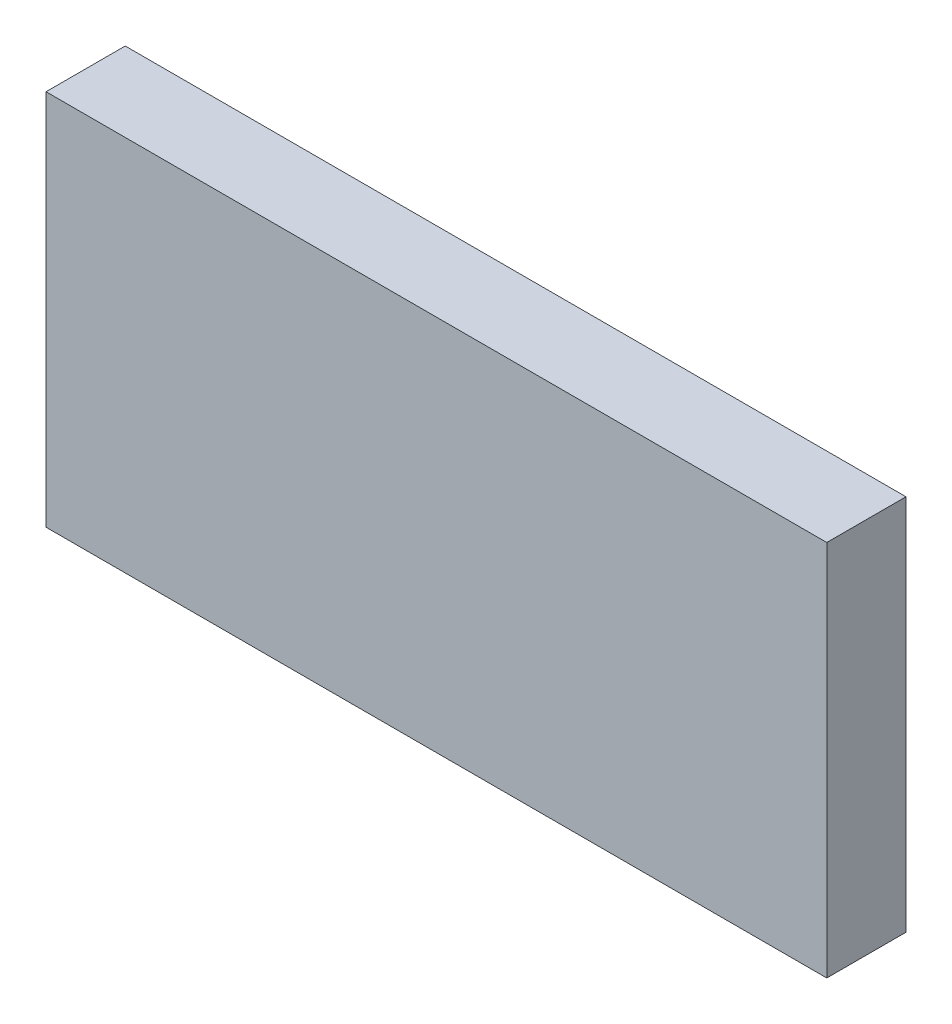
ISO-10303-21;
HEADER;
FILE_DESCRIPTION(('STEP AP214'),'2;1');
FILE_NAME('part.step','',(''),(''),'','','');
FILE_SCHEMA(('AUTOMOTIVE_DESIGN { 1 0 10303 214 1 1 1 1 }'));
ENDSEC;
DATA;
#1=APPLICATION_CONTEXT('core data for automotive mechanical design processes');
#2=APPLICATION_PROTOCOL_DEFINITION('international standard','automotive_design',2000,#1);
#3=PRODUCT_CONTEXT('',#1,'mechanical');
#4=PRODUCT('Part','Part','',(#3));
#5=PRODUCT_RELATED_PRODUCT_CATEGORY('part','',(#4));
#6=PRODUCT_DEFINITION_FORMATION('','',#4);
#7=PRODUCT_DEFINITION_CONTEXT('part definition',#1,'design');
#8=PRODUCT_DEFINITION('design','',#6,#7);
#9=PRODUCT_DEFINITION_SHAPE('','',#8);
#10=(LENGTH_UNIT() NAMED_UNIT(*) SI_UNIT(.MILLI.,.METRE.));
#11=(NAMED_UNIT(*) PLANE_ANGLE_UNIT() SI_UNIT($,.RADIAN.));
#12=(NAMED_UNIT(*) SI_UNIT($,.STERADIAN.) SOLID_ANGLE_UNIT());
#13=UNCERTAINTY_MEASURE_WITH_UNIT(LENGTH_MEASURE(1.E-05),#10,'distance_accuracy_value','');
#14=(GEOMETRIC_REPRESENTATION_CONTEXT(3) GLOBAL_UNCERTAINTY_ASSIGNED_CONTEXT((#13)) GLOBAL_UNIT_ASSIGNED_CONTEXT((#10,
#11,#12)) REPRESENTATION_CONTEXT('',''));
#15=CARTESIAN_POINT('',(0.,0.,0.));
#16=DIRECTION('',(0.,0.,1.));
#17=DIRECTION('',(1.,0.,0.));
#18=AXIS2_PLACEMENT_3D('',#15,#16,#17);
#19=CARTESIAN_POINT('',(26.289,-12.7,5.334));
#20=DIRECTION('',(-1.,0.,0.));
#21=DIRECTION('',(0.,0.,1.));
#22=AXIS2_PLACEMENT_3D('',#19,#20,#21);
#23=PLANE('',#22);
#24=DIRECTION('',(0.,1.,0.));
#25=VECTOR('',#24,1.);
#26=CARTESIAN_POINT('',(26.289,-12.7,0.));
#27=LINE('',#26,#25);
#28=CARTESIAN_POINT('',(26.289,-12.7,0.));
#29=VERTEX_POINT('',#28);
#30=CARTESIAN_POINT('',(26.289,12.7,0.));
#31=VERTEX_POINT('',#30);
#32=EDGE_CURVE('E99',#29,#31,#27,.T.);
#33=ORIENTED_EDGE('',*,*,#32,.T.);
#34=DIRECTION('',(0.,0.,-1.));
#35=VECTOR('',#34,1.);
#36=CARTESIAN_POINT('',(26.289,12.7,5.334));
#37=LINE('',#36,#35);
#38=CARTESIAN_POINT('',(26.289,12.7,5.334));
#39=VERTEX_POINT('',#38);
#40=EDGE_CURVE('E11',#39,#31,#37,.T.);
#41=ORIENTED_EDGE('',*,*,#40,.F.);
#42=DIRECTION('',(0.,1.,0.));
#43=VECTOR('',#42,1.);
#44=CARTESIAN_POINT('',(26.289,-12.7,5.334));
#45=LINE('',#44,#43);
#46=CARTESIAN_POINT('',(26.289,-12.7,5.334));
#47=VERTEX_POINT('',#46);
#48=EDGE_CURVE('E87',#47,#39,#45,.T.);
#49=ORIENTED_EDGE('',*,*,#48,.F.);
#50=DIRECTION('',(0.,0.,-1.));
#51=VECTOR('',#50,1.);
#52=CARTESIAN_POINT('',(26.289,-12.7,5.334));
#53=LINE('',#52,#51);
#54=EDGE_CURVE('E95',#47,#29,#53,.T.);
#55=ORIENTED_EDGE('',*,*,#54,.T.);
#56=EDGE_LOOP('',(#33,#41,#49,#55));
#57=FACE_BOUND('',#56,.T.);
#58=ADVANCED_FACE('F36',(#57),#23,.F.);
#59=CARTESIAN_POINT('',(-26.289,12.7,5.334));
#60=DIRECTION('',(0.,-1.,0.));
#61=DIRECTION('',(0.,0.,-1.));
#62=AXIS2_PLACEMENT_3D('',#59,#60,#61);
#63=PLANE('',#62);
#64=DIRECTION('',(-1.,0.,0.));
#65=VECTOR('',#64,1.);
#66=CARTESIAN_POINT('',(-26.289,12.7,0.));
#67=LINE('',#66,#65);
#68=CARTESIAN_POINT('',(-26.289,12.7,0.));
#69=VERTEX_POINT('',#68);
#70=EDGE_CURVE('E91',#31,#69,#67,.T.);
#71=ORIENTED_EDGE('',*,*,#70,.T.);
#72=DIRECTION('',(0.,0.,-1.));
#73=VECTOR('',#72,1.);
#74=CARTESIAN_POINT('',(-26.289,12.7,5.334));
#75=LINE('',#74,#73);
#76=CARTESIAN_POINT('',(-26.289,12.7,5.334));
#77=VERTEX_POINT('',#76);
#78=EDGE_CURVE('E44',#77,#69,#75,.T.);
#79=ORIENTED_EDGE('',*,*,#78,.F.);
#80=DIRECTION('',(-1.,0.,0.));
#81=VECTOR('',#80,1.);
#82=CARTESIAN_POINT('',(-26.289,12.7,5.334));
#83=LINE('',#82,#81);
#84=EDGE_CURVE('E82',#39,#77,#83,.T.);
#85=ORIENTED_EDGE('',*,*,#84,.F.);
#86=ORIENTED_EDGE('',*,*,#40,.T.);
#87=EDGE_LOOP('',(#71,#79,#85,#86));
#88=FACE_BOUND('',#87,.T.);
#89=ADVANCED_FACE('F90',(#88),#63,.F.);
#90=CARTESIAN_POINT('',(-26.289,-12.7,5.334));
#91=DIRECTION('',(1.,0.,0.));
#92=DIRECTION('',(0.,0.,-1.));
#93=AXIS2_PLACEMENT_3D('',#90,#91,#92);
#94=PLANE('',#93);
#95=DIRECTION('',(0.,-1.,0.));
#96=VECTOR('',#95,1.);
#97=CARTESIAN_POINT('',(-26.289,-12.7,0.));
#98=LINE('',#97,#96);
#99=CARTESIAN_POINT('',(-26.289,-12.7,0.));
#100=VERTEX_POINT('',#99);
#101=EDGE_CURVE('E69',#69,#100,#98,.T.);
#102=ORIENTED_EDGE('',*,*,#101,.T.);
#103=DIRECTION('',(0.,0.,-1.));
#104=VECTOR('',#103,1.);
#105=CARTESIAN_POINT('',(-26.289,-12.7,5.334));
#106=LINE('',#105,#104);
#107=CARTESIAN_POINT('',(-26.289,-12.7,5.334));
#108=VERTEX_POINT('',#107);
#109=EDGE_CURVE('E92',#108,#100,#106,.T.);
#110=ORIENTED_EDGE('',*,*,#109,.F.);
#111=DIRECTION('',(0.,-1.,0.));
#112=VECTOR('',#111,1.);
#113=CARTESIAN_POINT('',(-26.289,-12.7,5.334));
#114=LINE('',#113,#112);
#115=EDGE_CURVE('E85',#77,#108,#114,.T.);
#116=ORIENTED_EDGE('',*,*,#115,.F.);
#117=ORIENTED_EDGE('',*,*,#78,.T.);
#118=EDGE_LOOP('',(#102,#110,#116,#117));
#119=FACE_BOUND('',#118,.T.);
#120=ADVANCED_FACE('F93',(#119),#94,.F.);
#121=CARTESIAN_POINT('',(-26.289,-12.7,5.334));
#122=DIRECTION('',(0.,1.,0.));
#123=DIRECTION('',(0.,0.,1.));
#124=AXIS2_PLACEMENT_3D('',#121,#122,#123);
#125=PLANE('',#124);
#126=DIRECTION('',(1.,0.,0.));
#127=VECTOR('',#126,1.);
#128=CARTESIAN_POINT('',(-26.289,-12.7,0.));
#129=LINE('',#128,#127);
#130=EDGE_CURVE('E75',#100,#29,#129,.T.);
#131=ORIENTED_EDGE('',*,*,#130,.T.);
#132=ORIENTED_EDGE('',*,*,#54,.F.);
#133=DIRECTION('',(1.,0.,0.));
#134=VECTOR('',#133,1.);
#135=CARTESIAN_POINT('',(-26.289,-12.7,5.334));
#136=LINE('',#135,#134);
#137=EDGE_CURVE('E52',#108,#47,#136,.T.);
#138=ORIENTED_EDGE('',*,*,#137,.F.);
#139=ORIENTED_EDGE('',*,*,#109,.T.);
#140=EDGE_LOOP('',(#131,#132,#138,#139));
#141=FACE_BOUND('',#140,.T.);
#142=ADVANCED_FACE('F106',(#141),#125,.F.);
#143=CARTESIAN_POINT('',(0.,0.,5.334));
#144=DIRECTION('',(0.,0.,-1.));
#145=DIRECTION('',(-1.,0.,0.));
#146=AXIS2_PLACEMENT_3D('',#143,#144,#145);
#147=PLANE('',#146);
#148=ORIENTED_EDGE('',*,*,#48,.T.);
#149=ORIENTED_EDGE('',*,*,#84,.T.);
#150=ORIENTED_EDGE('',*,*,#115,.T.);
#151=ORIENTED_EDGE('',*,*,#137,.T.);
#152=EDGE_LOOP('',(#148,#149,#150,#151));
#153=FACE_BOUND('',#152,.T.);
#154=ADVANCED_FACE('F83',(#153),#147,.F.);
#155=CARTESIAN_POINT('',(0.,0.,0.));
#156=DIRECTION('',(0.,0.,-1.));
#157=DIRECTION('',(-1.,0.,0.));
#158=AXIS2_PLACEMENT_3D('',#155,#156,#157);
#159=PLANE('',#158);
#160=ORIENTED_EDGE('',*,*,#32,.F.);
#161=ORIENTED_EDGE('',*,*,#130,.F.);
#162=ORIENTED_EDGE('',*,*,#101,.F.);
#163=ORIENTED_EDGE('',*,*,#70,.F.);
#164=EDGE_LOOP('',(#160,#161,#162,#163));
#165=FACE_BOUND('',#164,.T.);
#166=ADVANCED_FACE('F109',(#165),#159,.T.);
#167=CLOSED_SHELL('',(#58,#89,#120,#142,#154,#166));
#168=MANIFOLD_SOLID_BREP('B2',#167);
#169=ADVANCED_BREP_SHAPE_REPRESENTATION('',(#18,#168),#14);
#170=SHAPE_DEFINITION_REPRESENTATION(#9,#169);
ENDSEC;
END-ISO-10303-21;
